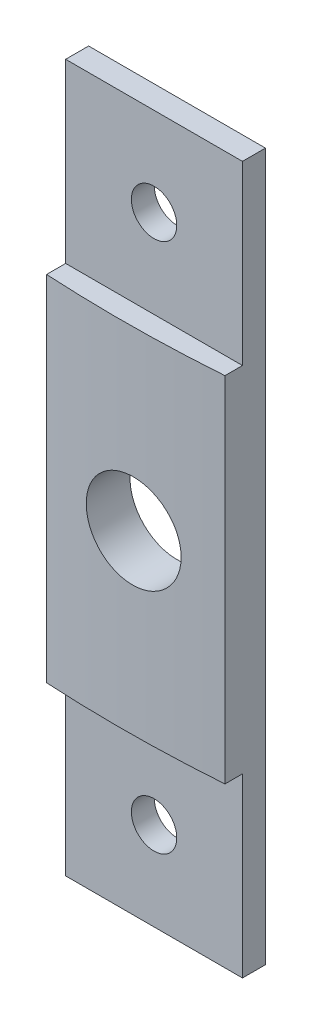
ISO-10303-21;
HEADER;
FILE_DESCRIPTION(('STEP AP214'),'2;1');
FILE_NAME('part.step','',(''),(''),'','','');
FILE_SCHEMA(('AUTOMOTIVE_DESIGN { 1 0 10303 214 1 1 1 1 }'));
ENDSEC;
DATA;
#1=APPLICATION_CONTEXT('core data for automotive mechanical design processes');
#2=APPLICATION_PROTOCOL_DEFINITION('international standard','automotive_design',2000,#1);
#3=PRODUCT_CONTEXT('',#1,'mechanical');
#4=PRODUCT('Part','Part','',(#3));
#5=PRODUCT_RELATED_PRODUCT_CATEGORY('part','',(#4));
#6=PRODUCT_DEFINITION_FORMATION('','',#4);
#7=PRODUCT_DEFINITION_CONTEXT('part definition',#1,'design');
#8=PRODUCT_DEFINITION('design','',#6,#7);
#9=PRODUCT_DEFINITION_SHAPE('','',#8);
#10=(LENGTH_UNIT() NAMED_UNIT(*) SI_UNIT(.MILLI.,.METRE.));
#11=(NAMED_UNIT(*) PLANE_ANGLE_UNIT() SI_UNIT($,.RADIAN.));
#12=(NAMED_UNIT(*) SI_UNIT($,.STERADIAN.) SOLID_ANGLE_UNIT());
#13=UNCERTAINTY_MEASURE_WITH_UNIT(LENGTH_MEASURE(1.E-05),#10,'distance_accuracy_value','');
#14=(GEOMETRIC_REPRESENTATION_CONTEXT(3) GLOBAL_UNCERTAINTY_ASSIGNED_CONTEXT((#13)) GLOBAL_UNIT_ASSIGNED_CONTEXT((#10,
#11,#12)) REPRESENTATION_CONTEXT('',''));
#15=CARTESIAN_POINT('',(0.,0.,0.));
#16=DIRECTION('',(0.,0.,1.));
#17=DIRECTION('',(1.,0.,0.));
#18=AXIS2_PLACEMENT_3D('',#15,#16,#17);
#19=CARTESIAN_POINT('',(0.,-278.797022402708,-95.25));
#20=DIRECTION('',(0.,1.,0.));
#21=DIRECTION('',(0.,0.,1.));
#22=AXIS2_PLACEMENT_3D('',#19,#20,#21);
#23=CYLINDRICAL_SURFACE('',#22,98.425);
#24=CARTESIAN_POINT('',(0.,2.37479674796748,-95.25));
#25=DIRECTION('',(0.,1.,0.));
#26=DIRECTION('',(0.,0.,1.));
#27=AXIS2_PLACEMENT_3D('',#24,#25,#26);
#28=CIRCLE('',#27,98.425);
#29=CARTESIAN_POINT('',(7.22764227642276,2.37479674796748,2.90926758143659));
#30=VERTEX_POINT('',#29);
#31=CARTESIAN_POINT('',(-5.47235772357724,2.37479674796748,3.02275271378738));
#32=VERTEX_POINT('',#31);
#33=EDGE_CURVE('E113',#30,#32,#28,.F.);
#34=ORIENTED_EDGE('',*,*,#33,.F.);
#35=DIRECTION('',(0.,1.,0.));
#36=VECTOR('',#35,1.);
#37=CARTESIAN_POINT('',(7.22764227642279,-278.797022402708,2.90926758143659));
#38=LINE('',#37,#36);
#39=CARTESIAN_POINT('',(7.22764227642276,27.7747967479675,2.9092675814366));
#40=VERTEX_POINT('',#39);
#41=EDGE_CURVE('E118',#40,#30,#38,.F.);
#42=ORIENTED_EDGE('',*,*,#41,.F.);
#43=CARTESIAN_POINT('',(0.,27.7747967479675,-95.25));
#44=DIRECTION('',(0.,-1.,0.));
#45=DIRECTION('',(0.,0.,-1.));
#46=AXIS2_PLACEMENT_3D('',#43,#44,#45);
#47=CIRCLE('',#46,98.425);
#48=CARTESIAN_POINT('',(-5.47235772357724,27.7747967479675,3.02275271378739));
#49=VERTEX_POINT('',#48);
#50=EDGE_CURVE('E48',#40,#49,#47,.T.);
#51=ORIENTED_EDGE('',*,*,#50,.T.);
#52=DIRECTION('',(0.,1.,0.));
#53=VECTOR('',#52,1.);
#54=CARTESIAN_POINT('',(-5.4723577235772,-278.797022402708,3.02275271378739));
#55=LINE('',#54,#53);
#56=EDGE_CURVE('E109',#49,#32,#55,.F.);
#57=ORIENTED_EDGE('',*,*,#56,.T.);
#58=EDGE_LOOP('',(#34,#42,#51,#57));
#59=FACE_BOUND('',#58,.T.);
#60=CARTESIAN_POINT('',(0.,18.337001412705,3.17500000000001));
#61=CARTESIAN_POINT('',(0.183163774329728,18.3862699131995,3.17499923295771));
#62=CARTESIAN_POINT('',(0.370618506350538,18.420112357294,3.1744833048946));
#63=CARTESIAN_POINT('',(0.748696883253728,18.4558831728512,3.17233438141036));
#64=CARTESIAN_POINT('',(0.939324030989922,18.4577735503428,3.17070005851524));
#65=CARTESIAN_POINT('',(1.31810349634827,18.4295342032097,3.16635570330243));
#66=CARTESIAN_POINT('',(1.50625697091006,18.3994200286868,3.16364619378798));
#67=CARTESIAN_POINT('',(1.87477767555351,18.3080601384446,3.15731586236169));
#68=CARTESIAN_POINT('',(2.05514678005276,18.246821963039,3.15369526128434));
#69=CARTESIAN_POINT('',(2.40311827028649,18.0949308812085,3.14581279900255));
#70=CARTESIAN_POINT('',(2.57071528735451,18.0042656886182,3.14155067035122));
#71=CARTESIAN_POINT('',(2.8883186641795,17.7960960163174,3.13273994796942));
#72=CARTESIAN_POINT('',(3.03832427364177,17.6785903924598,3.12819134203307));
#73=CARTESIAN_POINT('',(3.31657209541615,17.4199941230677,3.11920455482662));
#74=CARTESIAN_POINT('',(3.4448015474168,17.2788897446755,3.11476643959231));
#75=CARTESIAN_POINT('',(3.6757511501773,16.9771424388507,3.10640738089549));
#76=CARTESIAN_POINT('',(3.77847135945796,16.8164995562426,3.10248643624655));
#77=CARTESIAN_POINT('',(3.95547236390289,16.4802474922343,3.09552731700965));
#78=CARTESIAN_POINT('',(4.02975622278909,16.3046399256174,3.09248904733113));
#79=CARTESIAN_POINT('',(4.14778175991391,15.9434296465907,3.08758206459831));
#80=CARTESIAN_POINT('',(4.19152365595121,15.7578270054671,3.08571334320381));
#81=CARTESIAN_POINT('',(4.24719352568425,15.3820539635518,3.0833247698372));
#82=CARTESIAN_POINT('',(4.2591469367588,15.1918873379351,3.08280383936196));
#83=CARTESIAN_POINT('',(4.25097162182068,14.8122464901152,3.08315758298348));
#84=CARTESIAN_POINT('',(4.23084296557456,14.6227722664072,3.08403225404533));
#85=CARTESIAN_POINT('',(4.15909521199345,14.2499844164746,3.08709281873213));
#86=CARTESIAN_POINT('',(4.10749047589063,14.066668020909,3.08927811436575));
#87=CARTESIAN_POINT('',(3.97427343139461,13.711301571906,3.09475172078679));
#88=CARTESIAN_POINT('',(3.89266104142145,13.5392515490991,3.09804003457291));
#89=CARTESIAN_POINT('',(3.7016994688612,13.2112048603761,3.10541237133611));
#90=CARTESIAN_POINT('',(3.59233628440084,13.0552163544397,3.10949679575489));
#91=CARTESIAN_POINT('',(3.34899567947401,12.7638052149987,3.11808238570689));
#92=CARTESIAN_POINT('',(3.21501813116291,12.6283826883185,3.12258355340458));
#93=CARTESIAN_POINT('',(2.92612863370945,12.3818379238092,3.13160017938744));
#94=CARTESIAN_POINT('',(2.77120036625512,12.2707348065599,3.1361156461056));
#95=CARTESIAN_POINT('',(2.44488040810793,12.0761153318647,3.14476503433411));
#96=CARTESIAN_POINT('',(2.27348871175923,11.9925989838959,3.1488989557134));
#97=CARTESIAN_POINT('',(1.9190910085905,11.8555237927114,3.15644846982117));
#98=CARTESIAN_POINT('',(1.7360843655135,11.8019665922123,3.15986402315378));
#99=CARTESIAN_POINT('',(1.3636610963515,11.7263456210613,3.16572902326381));
#100=CARTESIAN_POINT('',(1.17424449522206,11.7042817278127,3.16817847380204));
#101=CARTESIAN_POINT('',(0.794502737236001,11.6922846944263,3.17197630756217));
#102=CARTESIAN_POINT('',(0.604178213629432,11.7023317222101,3.17332536975065));
#103=CARTESIAN_POINT('',(0.227911860858423,11.7542315993472,3.174915989193));
#104=CARTESIAN_POINT('',(0.041970021364355,11.7960843737292,3.17515754905743));
#105=CARTESIAN_POINT('',(-0.320181206052002,11.9103859625722,3.17464585069786));
#106=CARTESIAN_POINT('',(-0.496394170491173,11.9828234476875,3.17389296062354));
#107=CARTESIAN_POINT('',(-0.834163478701133,12.1562360566521,3.17161020455872));
#108=CARTESIAN_POINT('',(-0.995719788227125,12.2572112471767,3.17008033675289));
#109=CARTESIAN_POINT('',(-1.29963908752983,12.4848662961968,3.16653675381038));
#110=CARTESIAN_POINT('',(-1.44199664706101,12.6115534018714,3.16452290222816));
#111=CARTESIAN_POINT('',(-1.70342950580691,12.8870213305123,3.1603454308796));
#112=CARTESIAN_POINT('',(-1.82250477877466,13.0358021783854,3.15818181094442));
#113=CARTESIAN_POINT('',(-2.03403509884422,13.3512964635848,3.15403732242825));
#114=CARTESIAN_POINT('',(-2.12648063827912,13.5180162765876,3.15205651928981));
#115=CARTESIAN_POINT('',(-2.28206969548512,13.8646149047119,3.14857148784348));
#116=CARTESIAN_POINT('',(-2.34521318969307,14.044493730415,3.14706725991883));
#117=CARTESIAN_POINT('',(-2.4403977283043,14.4122833549272,3.14475276351811));
#118=CARTESIAN_POINT('',(-2.47244225527235,14.6001932519293,3.14394241734007));
#119=CARTESIAN_POINT('',(-2.50452941165419,14.9787277010001,3.14313097183225));
#120=CARTESIAN_POINT('',(-2.50457203705453,15.1693522534092,3.14312987260395));
#121=CARTESIAN_POINT('',(-2.47265841019071,15.5478526727738,3.14393697143129));
#122=CARTESIAN_POINT('',(-2.44071031229707,15.7357292278062,3.14474496325126));
#123=CARTESIAN_POINT('',(-2.34573740015336,16.1034440766247,3.14705470933214));
#124=CARTESIAN_POINT('',(-2.28271376063673,16.2832826739854,3.14855643736795));
#125=CARTESIAN_POINT('',(-2.12738281212904,16.6298260717582,3.15203692611609));
#126=CARTESIAN_POINT('',(-2.03507574237078,16.7965309794529,3.15401568293126));
#127=CARTESIAN_POINT('',(-1.82376422734408,17.1121244745433,3.15815836651779));
#128=CARTESIAN_POINT('',(-1.70475316928609,17.2610086349057,3.16032233907243));
#129=CARTESIAN_POINT('',(-1.44334539317461,17.5367861292119,3.16450326839776));
#130=CARTESIAN_POINT('',(-1.30093105885671,17.6636627484751,3.16652011275713));
#131=CARTESIAN_POINT('',(-0.9969207175112,17.8915784422674,3.17006789259945));
#132=CARTESIAN_POINT('',(-0.835347778578186,17.9926481364311,3.17159940444944));
#133=CARTESIAN_POINT('',(-0.560410582586963,18.1339668027216,3.17346205936598));
#134=CARTESIAN_POINT('',(-0.451402499054938,18.1828684278914,3.17402774268829));
#135=CARTESIAN_POINT('',(-0.22882937043118,18.2688834853283,3.17479695436329));
#136=CARTESIAN_POINT('',(-0.115264325101369,18.3059969169796,3.17500048269706));
#137=CARTESIAN_POINT('',(0.,18.337001412705,3.17500000000001));
#138=B_SPLINE_CURVE_WITH_KNOTS('',3,(#60,#61,#62,#63,#64,#65,#66,#67,#68,#69,#70,#71,#72,#73,
#74,#75,#76,#77,#78,#79,#80,#81,#82,#83,#84,#85,#86,#87,#88,#89,#90,#91,#92,#93,#94,#95,#96,#97,
#98,#99,#100,#101,#102,#103,#104,#105,#106,#107,#108,#109,#110,#111,#112,#113,#114,#115,#116,
#117,#118,#119,#120,#121,#122,#123,#124,#125,#126,#127,#128,#129,#130,#131,#132,#133,#134,#135,
#136,#137),.UNSPECIFIED.,.T.,.F.,(4,2,2,2,2,2,2,2,2,2,2,2,2,2,2,2,2,2,2,2,2,2,2,2,2,2,2,2,2,2,2,
2,2,2,2,2,2,2,4),(0.,0.56858743862936,1.13785093296673,1.70683796475568,2.27568721550947,
2.84477427445617,3.41388559683012,3.98332926276382,4.55277162232337,5.12215261309395,
5.69152954349385,6.26045071700899,6.82937065333402,7.39803120901285,7.96669331068534,
8.53564290763281,9.10459545973286,9.67399374371524,10.2433922233086,10.8128219210355,
11.3822494020859,11.9513252660743,12.5203997886633,13.0892636964301,13.6581289332947,
14.2271547341611,14.7961811765071,15.365410528405,15.9346403380459,16.5038063961,
17.072972525535,17.6419936125993,18.210993190888,18.7799881208193,19.3491241084971,
19.9186904788546,20.4875778913981,20.845387967056,21.2031980614077),.UNSPECIFIED.);
#139=CARTESIAN_POINT('',(0.,18.337001412705,3.17500000000001));
#140=VERTEX_POINT('',#139);
#141=EDGE_CURVE('E12',#140,#140,#138,.T.);
#142=ORIENTED_EDGE('',*,*,#141,.T.);
#143=EDGE_LOOP('',(#142));
#144=FACE_BOUND('',#143,.T.);
#145=ADVANCED_FACE('F39',(#59,#144),#23,.T.);
#146=CARTESIAN_POINT('',(-5.47235772357724,40.4747967479675,3.175));
#147=DIRECTION('',(1.,0.,0.));
#148=DIRECTION('',(0.,1.,0.));
#149=AXIS2_PLACEMENT_3D('',#146,#147,#148);
#150=PLANE('',#149);
#151=ORIENTED_EDGE('',*,*,#56,.F.);
#152=DIRECTION('',(0.,0.,-1.));
#153=VECTOR('',#152,1.);
#154=CARTESIAN_POINT('',(-5.47235772357724,27.7747967479675,3.175));
#155=LINE('',#154,#153);
#156=CARTESIAN_POINT('',(-5.47235772357724,27.7747967479675,1.651));
#157=VERTEX_POINT('',#156);
#158=EDGE_CURVE('E227',#49,#157,#155,.T.);
#159=ORIENTED_EDGE('',*,*,#158,.T.);
#160=DIRECTION('',(0.,1.,0.));
#161=VECTOR('',#160,1.);
#162=CARTESIAN_POINT('',(-5.47235772357724,40.4747967479675,1.651));
#163=LINE('',#162,#161);
#164=CARTESIAN_POINT('',(-5.47235772357724,40.4747967479675,1.651));
#165=VERTEX_POINT('',#164);
#166=EDGE_CURVE('E224',#157,#165,#163,.T.);
#167=ORIENTED_EDGE('',*,*,#166,.T.);
#168=DIRECTION('',(0.,0.,-1.));
#169=VECTOR('',#168,1.);
#170=CARTESIAN_POINT('',(-5.47235772357724,40.4747967479675,3.175));
#171=LINE('',#170,#169);
#172=CARTESIAN_POINT('',(-5.47235772357724,40.4747967479675,0.));
#173=VERTEX_POINT('',#172);
#174=EDGE_CURVE('E56',#165,#173,#171,.T.);
#175=ORIENTED_EDGE('',*,*,#174,.T.);
#176=DIRECTION('',(0.,-1.,0.));
#177=VECTOR('',#176,1.);
#178=CARTESIAN_POINT('',(-5.47235772357724,40.4747967479675,0.));
#179=LINE('',#178,#177);
#180=CARTESIAN_POINT('',(-5.47235772357724,-10.3252032520325,0.));
#181=VERTEX_POINT('',#180);
#182=EDGE_CURVE('E141',#173,#181,#179,.T.);
#183=ORIENTED_EDGE('',*,*,#182,.T.);
#184=DIRECTION('',(0.,0.,-1.));
#185=VECTOR('',#184,1.);
#186=CARTESIAN_POINT('',(-5.47235772357724,-10.3252032520325,3.175));
#187=LINE('',#186,#185);
#188=CARTESIAN_POINT('',(-5.47235772357724,-10.3252032520325,1.651));
#189=VERTEX_POINT('',#188);
#190=EDGE_CURVE('E157',#189,#181,#187,.T.);
#191=ORIENTED_EDGE('',*,*,#190,.F.);
#192=DIRECTION('',(0.,1.,0.));
#193=VECTOR('',#192,1.);
#194=CARTESIAN_POINT('',(-5.47235772357724,-10.3252032520325,1.651));
#195=LINE('',#194,#193);
#196=CARTESIAN_POINT('',(-5.47235772357724,2.37479674796748,1.651));
#197=VERTEX_POINT('',#196);
#198=EDGE_CURVE('E131',#189,#197,#195,.T.);
#199=ORIENTED_EDGE('',*,*,#198,.T.);
#200=DIRECTION('',(0.,0.,1.));
#201=VECTOR('',#200,1.);
#202=CARTESIAN_POINT('',(-5.47235772357724,2.37479674796748,3.175));
#203=LINE('',#202,#201);
#204=EDGE_CURVE('E124',#197,#32,#203,.T.);
#205=ORIENTED_EDGE('',*,*,#204,.T.);
#206=EDGE_LOOP('',(#151,#159,#167,#175,#183,#191,#199,#205));
#207=FACE_BOUND('',#206,.T.);
#208=ADVANCED_FACE('F41',(#207),#150,.F.);
#209=CARTESIAN_POINT('',(7.22764227642276,40.4747967479675,3.175));
#210=DIRECTION('',(1.,0.,0.));
#211=DIRECTION('',(0.,1.,0.));
#212=AXIS2_PLACEMENT_3D('',#209,#210,#211);
#213=PLANE('',#212);
#214=DIRECTION('',(0.,0.,-1.));
#215=VECTOR('',#214,1.);
#216=CARTESIAN_POINT('',(7.22764227642276,27.7747967479675,3.175));
#217=LINE('',#216,#215);
#218=CARTESIAN_POINT('',(7.22764227642276,27.7747967479675,1.651));
#219=VERTEX_POINT('',#218);
#220=EDGE_CURVE('E139',#40,#219,#217,.T.);
#221=ORIENTED_EDGE('',*,*,#220,.F.);
#222=ORIENTED_EDGE('',*,*,#41,.T.);
#223=DIRECTION('',(0.,0.,1.));
#224=VECTOR('',#223,1.);
#225=CARTESIAN_POINT('',(7.22764227642276,2.37479674796748,3.175));
#226=LINE('',#225,#224);
#227=CARTESIAN_POINT('',(7.22764227642276,2.37479674796748,1.651));
#228=VERTEX_POINT('',#227);
#229=EDGE_CURVE('E127',#228,#30,#226,.T.);
#230=ORIENTED_EDGE('',*,*,#229,.F.);
#231=DIRECTION('',(0.,1.,0.));
#232=VECTOR('',#231,1.);
#233=CARTESIAN_POINT('',(7.22764227642276,-10.3252032520325,1.651));
#234=LINE('',#233,#232);
#235=CARTESIAN_POINT('',(7.22764227642276,-10.3252032520325,1.651));
#236=VERTEX_POINT('',#235);
#237=EDGE_CURVE('E117',#236,#228,#234,.T.);
#238=ORIENTED_EDGE('',*,*,#237,.F.);
#239=DIRECTION('',(0.,0.,-1.));
#240=VECTOR('',#239,1.);
#241=CARTESIAN_POINT('',(7.22764227642276,-10.3252032520325,3.175));
#242=LINE('',#241,#240);
#243=CARTESIAN_POINT('',(7.22764227642276,-10.3252032520325,0.));
#244=VERTEX_POINT('',#243);
#245=EDGE_CURVE('E155',#236,#244,#242,.T.);
#246=ORIENTED_EDGE('',*,*,#245,.T.);
#247=DIRECTION('',(0.,-1.,0.));
#248=VECTOR('',#247,1.);
#249=CARTESIAN_POINT('',(7.22764227642276,40.4747967479675,0.));
#250=LINE('',#249,#248);
#251=CARTESIAN_POINT('',(7.22764227642276,40.4747967479675,0.));
#252=VERTEX_POINT('',#251);
#253=EDGE_CURVE('E147',#252,#244,#250,.T.);
#254=ORIENTED_EDGE('',*,*,#253,.F.);
#255=DIRECTION('',(0.,0.,-1.));
#256=VECTOR('',#255,1.);
#257=CARTESIAN_POINT('',(7.22764227642276,40.4747967479675,3.175));
#258=LINE('',#257,#256);
#259=CARTESIAN_POINT('',(7.22764227642276,40.4747967479675,1.651));
#260=VERTEX_POINT('',#259);
#261=EDGE_CURVE('E64',#260,#252,#258,.T.);
#262=ORIENTED_EDGE('',*,*,#261,.F.);
#263=DIRECTION('',(0.,1.,0.));
#264=VECTOR('',#263,1.);
#265=CARTESIAN_POINT('',(7.22764227642276,40.4747967479675,1.651));
#266=LINE('',#265,#264);
#267=EDGE_CURVE('E229',#219,#260,#266,.T.);
#268=ORIENTED_EDGE('',*,*,#267,.F.);
#269=EDGE_LOOP('',(#221,#222,#230,#238,#246,#254,#262,#268));
#270=FACE_BOUND('',#269,.T.);
#271=ADVANCED_FACE('F188',(#270),#213,.T.);
#272=CARTESIAN_POINT('',(-5.47235772357724,2.37479674796748,3.175));
#273=DIRECTION('',(0.,1.,0.));
#274=DIRECTION('',(0.,0.,1.));
#275=AXIS2_PLACEMENT_3D('',#272,#273,#274);
#276=PLANE('',#275);
#277=ORIENTED_EDGE('',*,*,#229,.T.);
#278=ORIENTED_EDGE('',*,*,#33,.T.);
#279=ORIENTED_EDGE('',*,*,#204,.F.);
#280=DIRECTION('',(1.,0.,0.));
#281=VECTOR('',#280,1.);
#282=CARTESIAN_POINT('',(-5.47235772357724,2.37479674796748,1.651));
#283=LINE('',#282,#281);
#284=EDGE_CURVE('E134',#197,#228,#283,.T.);
#285=ORIENTED_EDGE('',*,*,#284,.T.);
#286=EDGE_LOOP('',(#277,#278,#279,#285));
#287=FACE_BOUND('',#286,.T.);
#288=ADVANCED_FACE('F123',(#287),#276,.F.);
#289=CARTESIAN_POINT('',(-5.47235772357724,27.7747967479675,3.175));
#290=DIRECTION('',(0.,-1.,0.));
#291=DIRECTION('',(0.,0.,-1.));
#292=AXIS2_PLACEMENT_3D('',#289,#290,#291);
#293=PLANE('',#292);
#294=ORIENTED_EDGE('',*,*,#50,.F.);
#295=ORIENTED_EDGE('',*,*,#220,.T.);
#296=DIRECTION('',(1.,0.,0.));
#297=VECTOR('',#296,1.);
#298=CARTESIAN_POINT('',(-5.47235772357724,27.7747967479675,1.651));
#299=LINE('',#298,#297);
#300=EDGE_CURVE('E221',#157,#219,#299,.T.);
#301=ORIENTED_EDGE('',*,*,#300,.F.);
#302=ORIENTED_EDGE('',*,*,#158,.F.);
#303=EDGE_LOOP('',(#294,#295,#301,#302));
#304=FACE_BOUND('',#303,.T.);
#305=ADVANCED_FACE('F197',(#304),#293,.F.);
#306=CARTESIAN_POINT('',(-5.47235772357724,-10.3252032520325,3.175));
#307=DIRECTION('',(0.,1.,0.));
#308=DIRECTION('',(0.,0.,1.));
#309=AXIS2_PLACEMENT_3D('',#306,#307,#308);
#310=PLANE('',#309);
#311=ORIENTED_EDGE('',*,*,#245,.F.);
#312=DIRECTION('',(1.,0.,0.));
#313=VECTOR('',#312,1.);
#314=CARTESIAN_POINT('',(-5.47235772357724,-10.3252032520325,1.651));
#315=LINE('',#314,#313);
#316=EDGE_CURVE('E132',#189,#236,#315,.T.);
#317=ORIENTED_EDGE('',*,*,#316,.F.);
#318=ORIENTED_EDGE('',*,*,#190,.T.);
#319=DIRECTION('',(1.,0.,0.));
#320=VECTOR('',#319,1.);
#321=CARTESIAN_POINT('',(-5.47235772357724,-10.3252032520325,0.));
#322=LINE('',#321,#320);
#323=EDGE_CURVE('E143',#181,#244,#322,.T.);
#324=ORIENTED_EDGE('',*,*,#323,.T.);
#325=EDGE_LOOP('',(#311,#317,#318,#324));
#326=FACE_BOUND('',#325,.T.);
#327=ADVANCED_FACE('F203',(#326),#310,.F.);
#328=CARTESIAN_POINT('',(-5.47235772357724,40.4747967479675,3.175));
#329=DIRECTION('',(0.,1.,0.));
#330=DIRECTION('',(0.,0.,1.));
#331=AXIS2_PLACEMENT_3D('',#328,#329,#330);
#332=PLANE('',#331);
#333=DIRECTION('',(1.,0.,0.));
#334=VECTOR('',#333,1.);
#335=CARTESIAN_POINT('',(-5.47235772357724,40.4747967479675,1.651));
#336=LINE('',#335,#334);
#337=EDGE_CURVE('E144',#165,#260,#336,.T.);
#338=ORIENTED_EDGE('',*,*,#337,.T.);
#339=ORIENTED_EDGE('',*,*,#261,.T.);
#340=DIRECTION('',(1.,0.,0.));
#341=VECTOR('',#340,1.);
#342=CARTESIAN_POINT('',(-5.47235772357724,40.4747967479675,0.));
#343=LINE('',#342,#341);
#344=EDGE_CURVE('E150',#173,#252,#343,.T.);
#345=ORIENTED_EDGE('',*,*,#344,.F.);
#346=ORIENTED_EDGE('',*,*,#174,.F.);
#347=EDGE_LOOP('',(#338,#339,#345,#346));
#348=FACE_BOUND('',#347,.T.);
#349=ADVANCED_FACE('F201',(#348),#332,.T.);
#350=CARTESIAN_POINT('',(0.,0.,0.));
#351=DIRECTION('',(0.,0.,1.));
#352=DIRECTION('',(1.,0.,0.));
#353=AXIS2_PLACEMENT_3D('',#350,#351,#352);
#354=PLANE('',#353);
#355=CARTESIAN_POINT('',(0.877642276422763,-3.97520325203252,0.));
#356=DIRECTION('',(0.,0.,1.));
#357=DIRECTION('',(1.,0.,0.));
#358=AXIS2_PLACEMENT_3D('',#355,#356,#357);
#359=CIRCLE('',#358,1.63195);
#360=CARTESIAN_POINT('',(-0.754307723577237,-3.97520325203252,0.));
#361=VERTEX_POINT('',#360);
#362=EDGE_CURVE('E128',#361,#361,#359,.F.);
#363=ORIENTED_EDGE('',*,*,#362,.F.);
#364=EDGE_LOOP('',(#363));
#365=FACE_BOUND('',#364,.T.);
#366=CARTESIAN_POINT('',(0.877642276422763,34.1247967479675,0.));
#367=DIRECTION('',(0.,0.,1.));
#368=DIRECTION('',(1.,0.,0.));
#369=AXIS2_PLACEMENT_3D('',#366,#367,#368);
#370=CIRCLE('',#369,1.63195);
#371=CARTESIAN_POINT('',(-0.754307723577237,34.1247967479675,0.));
#372=VERTEX_POINT('',#371);
#373=EDGE_CURVE('E235',#372,#372,#370,.F.);
#374=ORIENTED_EDGE('',*,*,#373,.F.);
#375=EDGE_LOOP('',(#374));
#376=FACE_BOUND('',#375,.T.);
#377=CARTESIAN_POINT('',(0.877642276422763,15.0747967479675,0.));
#378=DIRECTION('',(0.,0.,1.));
#379=DIRECTION('',(1.,0.,0.));
#380=AXIS2_PLACEMENT_3D('',#377,#378,#379);
#381=CIRCLE('',#380,3.3782);
#382=CARTESIAN_POINT('',(4.25584227642276,15.0747967479675,0.));
#383=VERTEX_POINT('',#382);
#384=EDGE_CURVE('E238',#383,#383,#381,.F.);
#385=ORIENTED_EDGE('',*,*,#384,.F.);
#386=EDGE_LOOP('',(#385));
#387=FACE_BOUND('',#386,.T.);
#388=ORIENTED_EDGE('',*,*,#182,.F.);
#389=ORIENTED_EDGE('',*,*,#344,.T.);
#390=ORIENTED_EDGE('',*,*,#253,.T.);
#391=ORIENTED_EDGE('',*,*,#323,.F.);
#392=EDGE_LOOP('',(#388,#389,#390,#391));
#393=FACE_BOUND('',#392,.T.);
#394=ADVANCED_FACE('F210',(#365,#376,#387,#393),#354,.F.);
#395=CARTESIAN_POINT('',(-5.47235772357724,-10.3252032520325,1.651));
#396=DIRECTION('',(0.,0.,-1.));
#397=DIRECTION('',(-1.,0.,0.));
#398=AXIS2_PLACEMENT_3D('',#395,#396,#397);
#399=PLANE('',#398);
#400=CARTESIAN_POINT('',(0.877642276422763,-3.97520325203252,1.651));
#401=DIRECTION('',(0.,0.,-1.));
#402=DIRECTION('',(-1.,0.,0.));
#403=AXIS2_PLACEMENT_3D('',#400,#401,#402);
#404=CIRCLE('',#403,1.63195);
#405=CARTESIAN_POINT('',(-0.754307723577237,-3.97520325203252,1.651));
#406=VERTEX_POINT('',#405);
#407=EDGE_CURVE('E43',#406,#406,#404,.F.);
#408=ORIENTED_EDGE('',*,*,#407,.F.);
#409=EDGE_LOOP('',(#408));
#410=FACE_BOUND('',#409,.T.);
#411=ORIENTED_EDGE('',*,*,#284,.F.);
#412=ORIENTED_EDGE('',*,*,#198,.F.);
#413=ORIENTED_EDGE('',*,*,#316,.T.);
#414=ORIENTED_EDGE('',*,*,#237,.T.);
#415=EDGE_LOOP('',(#411,#412,#413,#414));
#416=FACE_BOUND('',#415,.T.);
#417=ADVANCED_FACE('F248',(#410,#416),#399,.F.);
#418=CARTESIAN_POINT('',(-5.47235772357724,40.4747967479675,1.651));
#419=DIRECTION('',(0.,0.,-1.));
#420=DIRECTION('',(0.,1.,0.));
#421=AXIS2_PLACEMENT_3D('',#418,#419,#420);
#422=PLANE('',#421);
#423=CARTESIAN_POINT('',(0.877642276422763,34.1247967479675,1.651));
#424=DIRECTION('',(0.,0.,-1.));
#425=DIRECTION('',(0.,1.,0.));
#426=AXIS2_PLACEMENT_3D('',#423,#424,#425);
#427=CIRCLE('',#426,1.63195);
#428=CARTESIAN_POINT('',(-0.754307723577237,34.1247967479675,1.651));
#429=VERTEX_POINT('',#428);
#430=EDGE_CURVE('E164',#429,#429,#427,.F.);
#431=ORIENTED_EDGE('',*,*,#430,.F.);
#432=EDGE_LOOP('',(#431));
#433=FACE_BOUND('',#432,.T.);
#434=ORIENTED_EDGE('',*,*,#337,.F.);
#435=ORIENTED_EDGE('',*,*,#166,.F.);
#436=ORIENTED_EDGE('',*,*,#300,.T.);
#437=ORIENTED_EDGE('',*,*,#267,.T.);
#438=EDGE_LOOP('',(#434,#435,#436,#437));
#439=FACE_BOUND('',#438,.T.);
#440=ADVANCED_FACE('F172',(#433,#439),#422,.F.);
#441=CARTESIAN_POINT('',(0.877642276422763,15.0747967479675,3.17500000000001));
#442=DIRECTION('',(0.,0.,-1.));
#443=DIRECTION('',(-1.,0.,0.));
#444=AXIS2_PLACEMENT_3D('',#441,#442,#443);
#445=CYLINDRICAL_SURFACE('',#444,3.3782);
#446=ORIENTED_EDGE('',*,*,#141,.F.);
#447=EDGE_LOOP('',(#446));
#448=FACE_BOUND('',#447,.T.);
#449=ORIENTED_EDGE('',*,*,#384,.T.);
#450=EDGE_LOOP('',(#449));
#451=FACE_BOUND('',#450,.T.);
#452=ADVANCED_FACE('F167',(#448,#451),#445,.F.);
#453=CARTESIAN_POINT('',(0.877642276422763,34.1247967479675,3.17500000000001));
#454=DIRECTION('',(0.,0.,-1.));
#455=DIRECTION('',(-1.,0.,0.));
#456=AXIS2_PLACEMENT_3D('',#453,#454,#455);
#457=CYLINDRICAL_SURFACE('',#456,1.63195);
#458=CARTESIAN_POINT('',(-0.754307723577237,34.1247967479675,1.651));
#459=CARTESIAN_POINT('',(-0.754307723577237,34.1247967479675,1.63380208333333));
#460=CARTESIAN_POINT('',(-0.754307723577237,34.1247967479675,1.61660416666667));
#461=CARTESIAN_POINT('',(-0.754307723577237,34.1247967479675,1.58220833333333));
#462=CARTESIAN_POINT('',(-0.754307723577237,34.1247967479675,1.56501041666667));
#463=CARTESIAN_POINT('',(-0.754307723577237,34.1247967479675,1.53061458333333));
#464=CARTESIAN_POINT('',(-0.754307723577237,34.1247967479675,1.51341666666667));
#465=CARTESIAN_POINT('',(-0.754307723577237,34.1247967479675,1.47902083333333));
#466=CARTESIAN_POINT('',(-0.754307723577237,34.1247967479675,1.46182291666667));
#467=CARTESIAN_POINT('',(-0.754307723577237,34.1247967479675,1.42742708333333));
#468=CARTESIAN_POINT('',(-0.754307723577237,34.1247967479675,1.41022916666667));
#469=CARTESIAN_POINT('',(-0.754307723577237,34.1247967479675,1.37583333333333));
#470=CARTESIAN_POINT('',(-0.754307723577237,34.1247967479675,1.35863541666667));
#471=CARTESIAN_POINT('',(-0.754307723577237,34.1247967479675,1.32423958333333));
#472=CARTESIAN_POINT('',(-0.754307723577237,34.1247967479675,1.30704166666667));
#473=CARTESIAN_POINT('',(-0.754307723577237,34.1247967479675,1.27264583333333));
#474=CARTESIAN_POINT('',(-0.754307723577237,34.1247967479675,1.25544791666667));
#475=CARTESIAN_POINT('',(-0.754307723577237,34.1247967479675,1.22105208333333));
#476=CARTESIAN_POINT('',(-0.754307723577237,34.1247967479675,1.20385416666667));
#477=CARTESIAN_POINT('',(-0.754307723577237,34.1247967479675,1.16945833333333));
#478=CARTESIAN_POINT('',(-0.754307723577237,34.1247967479675,1.15226041666667));
#479=CARTESIAN_POINT('',(-0.754307723577237,34.1247967479675,1.11786458333333));
#480=CARTESIAN_POINT('',(-0.754307723577237,34.1247967479675,1.10066666666667));
#481=CARTESIAN_POINT('',(-0.754307723577237,34.1247967479675,1.06627083333333));
#482=CARTESIAN_POINT('',(-0.754307723577237,34.1247967479675,1.04907291666667));
#483=CARTESIAN_POINT('',(-0.754307723577237,34.1247967479675,1.01467708333333));
#484=CARTESIAN_POINT('',(-0.754307723577237,34.1247967479675,0.997479166666666));
#485=CARTESIAN_POINT('',(-0.754307723577237,34.1247967479675,0.963083333333333));
#486=CARTESIAN_POINT('',(-0.754307723577237,34.1247967479675,0.945885416666666));
#487=CARTESIAN_POINT('',(-0.754307723577237,34.1247967479675,0.911489583333333));
#488=CARTESIAN_POINT('',(-0.754307723577237,34.1247967479675,0.894291666666666));
#489=CARTESIAN_POINT('',(-0.754307723577237,34.1247967479675,0.859895833333333));
#490=CARTESIAN_POINT('',(-0.754307723577237,34.1247967479675,0.842697916666666));
#491=CARTESIAN_POINT('',(-0.754307723577237,34.1247967479675,0.808302083333333));
#492=CARTESIAN_POINT('',(-0.754307723577237,34.1247967479675,0.791104166666666));
#493=CARTESIAN_POINT('',(-0.754307723577237,34.1247967479675,0.756708333333333));
#494=CARTESIAN_POINT('',(-0.754307723577237,34.1247967479675,0.739510416666666));
#495=CARTESIAN_POINT('',(-0.754307723577237,34.1247967479675,0.705114583333333));
#496=CARTESIAN_POINT('',(-0.754307723577237,34.1247967479675,0.687916666666666));
#497=CARTESIAN_POINT('',(-0.754307723577237,34.1247967479675,0.653520833333333));
#498=CARTESIAN_POINT('',(-0.754307723577237,34.1247967479675,0.636322916666666));
#499=CARTESIAN_POINT('',(-0.754307723577237,34.1247967479675,0.601927083333333));
#500=CARTESIAN_POINT('',(-0.754307723577237,34.1247967479675,0.584729166666666));
#501=CARTESIAN_POINT('',(-0.754307723577237,34.1247967479675,0.550333333333333));
#502=CARTESIAN_POINT('',(-0.754307723577237,34.1247967479675,0.533135416666666));
#503=CARTESIAN_POINT('',(-0.754307723577237,34.1247967479675,0.498739583333333));
#504=CARTESIAN_POINT('',(-0.754307723577237,34.1247967479675,0.481541666666666));
#505=CARTESIAN_POINT('',(-0.754307723577237,34.1247967479675,0.447145833333333));
#506=CARTESIAN_POINT('',(-0.754307723577237,34.1247967479675,0.429947916666666));
#507=CARTESIAN_POINT('',(-0.754307723577237,34.1247967479675,0.395552083333333));
#508=CARTESIAN_POINT('',(-0.754307723577237,34.1247967479675,0.378354166666666));
#509=CARTESIAN_POINT('',(-0.754307723577237,34.1247967479675,0.343958333333333));
#510=CARTESIAN_POINT('',(-0.754307723577237,34.1247967479675,0.326760416666666));
#511=CARTESIAN_POINT('',(-0.754307723577237,34.1247967479675,0.292364583333333));
#512=CARTESIAN_POINT('',(-0.754307723577237,34.1247967479675,0.275166666666666));
#513=CARTESIAN_POINT('',(-0.754307723577237,34.1247967479675,0.240770833333333));
#514=CARTESIAN_POINT('',(-0.754307723577237,34.1247967479675,0.223572916666666));
#515=CARTESIAN_POINT('',(-0.754307723577237,34.1247967479675,0.189177083333333));
#516=CARTESIAN_POINT('',(-0.754307723577237,34.1247967479675,0.171979166666666));
#517=CARTESIAN_POINT('',(-0.754307723577237,34.1247967479675,0.137583333333333));
#518=CARTESIAN_POINT('',(-0.754307723577237,34.1247967479675,0.120385416666666));
#519=CARTESIAN_POINT('',(-0.754307723577237,34.1247967479675,0.0859895833333329));
#520=CARTESIAN_POINT('',(-0.754307723577237,34.1247967479675,0.0687916666666662));
#521=CARTESIAN_POINT('',(-0.754307723577237,34.1247967479675,0.0343958333333329));
#522=CARTESIAN_POINT('',(-0.754307723577237,34.1247967479675,0.0171979166666662));
#523=CARTESIAN_POINT('',(-0.754307723577237,34.1247967479675,0.));
#524=B_SPLINE_CURVE_WITH_KNOTS('',3,(#458,#459,#460,#461,#462,#463,#464,#465,#466,#467,#468,
#469,#470,#471,#472,#473,#474,#475,#476,#477,#478,#479,#480,#481,#482,#483,#484,#485,#486,#487,
#488,#489,#490,#491,#492,#493,#494,#495,#496,#497,#498,#499,#500,#501,#502,#503,#504,#505,#506,
#507,#508,#509,#510,#511,#512,#513,#514,#515,#516,#517,#518,#519,#520,#521,#522,#523),
.UNSPECIFIED.,.F.,.F.,(4,2,2,2,2,2,2,2,2,2,2,2,2,2,2,2,2,2,2,2,2,2,2,2,2,2,2,2,2,2,2,2,4),(0.,
0.05159375,0.1031875,0.15478125,0.206375,0.25796875,0.3095625,0.36115625,0.41275,0.46434375,
0.5159375,0.56753125,0.619125,0.67071875,0.7223125,0.77390625,0.8255,0.87709375,0.9286875,
0.98028125,1.031875,1.08346875,1.1350625,1.18665625,1.23825,1.28984375,1.3414375,1.39303125,
1.444625,1.49621875,1.5478125,1.59940625,1.651),.UNSPECIFIED.);
#525=EDGE_CURVE('BSEAM171',#429,#372,#524,.T.);
#526=ORIENTED_EDGE('',*,*,#430,.T.);
#527=ORIENTED_EDGE('',*,*,#373,.T.);
#528=ORIENTED_EDGE('',*,*,#525,.T.);
#529=ORIENTED_EDGE('',*,*,#525,.F.);
#530=EDGE_LOOP('',(#526,#528,#527,#529));
#531=FACE_BOUND('',#530,.T.);
#532=ADVANCED_FACE('F171',(#531),#457,.F.);
#533=CARTESIAN_POINT('',(0.877642276422763,-3.97520325203252,3.17500000000001));
#534=DIRECTION('',(0.,0.,-1.));
#535=DIRECTION('',(-1.,0.,0.));
#536=AXIS2_PLACEMENT_3D('',#533,#534,#535);
#537=CYLINDRICAL_SURFACE('',#536,1.63195);
#538=CARTESIAN_POINT('',(-0.754307723577237,-3.97520325203252,1.651));
#539=CARTESIAN_POINT('',(-0.754307723577237,-3.97520325203252,1.63380208333333));
#540=CARTESIAN_POINT('',(-0.754307723577237,-3.97520325203252,1.61660416666667));
#541=CARTESIAN_POINT('',(-0.754307723577237,-3.97520325203252,1.58220833333333));
#542=CARTESIAN_POINT('',(-0.754307723577237,-3.97520325203252,1.56501041666667));
#543=CARTESIAN_POINT('',(-0.754307723577237,-3.97520325203252,1.53061458333333));
#544=CARTESIAN_POINT('',(-0.754307723577237,-3.97520325203252,1.51341666666667));
#545=CARTESIAN_POINT('',(-0.754307723577237,-3.97520325203252,1.47902083333333));
#546=CARTESIAN_POINT('',(-0.754307723577237,-3.97520325203252,1.46182291666667));
#547=CARTESIAN_POINT('',(-0.754307723577237,-3.97520325203252,1.42742708333333));
#548=CARTESIAN_POINT('',(-0.754307723577237,-3.97520325203252,1.41022916666667));
#549=CARTESIAN_POINT('',(-0.754307723577237,-3.97520325203252,1.37583333333333));
#550=CARTESIAN_POINT('',(-0.754307723577237,-3.97520325203252,1.35863541666667));
#551=CARTESIAN_POINT('',(-0.754307723577237,-3.97520325203252,1.32423958333333));
#552=CARTESIAN_POINT('',(-0.754307723577237,-3.97520325203252,1.30704166666667));
#553=CARTESIAN_POINT('',(-0.754307723577237,-3.97520325203252,1.27264583333333));
#554=CARTESIAN_POINT('',(-0.754307723577237,-3.97520325203252,1.25544791666667));
#555=CARTESIAN_POINT('',(-0.754307723577237,-3.97520325203252,1.22105208333333));
#556=CARTESIAN_POINT('',(-0.754307723577237,-3.97520325203252,1.20385416666667));
#557=CARTESIAN_POINT('',(-0.754307723577237,-3.97520325203252,1.16945833333333));
#558=CARTESIAN_POINT('',(-0.754307723577237,-3.97520325203252,1.15226041666667));
#559=CARTESIAN_POINT('',(-0.754307723577237,-3.97520325203252,1.11786458333333));
#560=CARTESIAN_POINT('',(-0.754307723577237,-3.97520325203252,1.10066666666667));
#561=CARTESIAN_POINT('',(-0.754307723577237,-3.97520325203252,1.06627083333333));
#562=CARTESIAN_POINT('',(-0.754307723577237,-3.97520325203252,1.04907291666667));
#563=CARTESIAN_POINT('',(-0.754307723577237,-3.97520325203252,1.01467708333333));
#564=CARTESIAN_POINT('',(-0.754307723577237,-3.97520325203252,0.997479166666666));
#565=CARTESIAN_POINT('',(-0.754307723577237,-3.97520325203252,0.963083333333333));
#566=CARTESIAN_POINT('',(-0.754307723577237,-3.97520325203252,0.945885416666666));
#567=CARTESIAN_POINT('',(-0.754307723577237,-3.97520325203252,0.911489583333333));
#568=CARTESIAN_POINT('',(-0.754307723577237,-3.97520325203252,0.894291666666666));
#569=CARTESIAN_POINT('',(-0.754307723577237,-3.97520325203252,0.859895833333333));
#570=CARTESIAN_POINT('',(-0.754307723577237,-3.97520325203252,0.842697916666666));
#571=CARTESIAN_POINT('',(-0.754307723577237,-3.97520325203252,0.808302083333333));
#572=CARTESIAN_POINT('',(-0.754307723577237,-3.97520325203252,0.791104166666666));
#573=CARTESIAN_POINT('',(-0.754307723577237,-3.97520325203252,0.756708333333333));
#574=CARTESIAN_POINT('',(-0.754307723577237,-3.97520325203252,0.739510416666667));
#575=CARTESIAN_POINT('',(-0.754307723577237,-3.97520325203252,0.705114583333333));
#576=CARTESIAN_POINT('',(-0.754307723577237,-3.97520325203252,0.687916666666667));
#577=CARTESIAN_POINT('',(-0.754307723577237,-3.97520325203252,0.653520833333333));
#578=CARTESIAN_POINT('',(-0.754307723577237,-3.97520325203252,0.636322916666667));
#579=CARTESIAN_POINT('',(-0.754307723577237,-3.97520325203252,0.601927083333333));
#580=CARTESIAN_POINT('',(-0.754307723577237,-3.97520325203252,0.584729166666667));
#581=CARTESIAN_POINT('',(-0.754307723577237,-3.97520325203252,0.550333333333333));
#582=CARTESIAN_POINT('',(-0.754307723577237,-3.97520325203252,0.533135416666666));
#583=CARTESIAN_POINT('',(-0.754307723577237,-3.97520325203252,0.498739583333333));
#584=CARTESIAN_POINT('',(-0.754307723577237,-3.97520325203252,0.481541666666666));
#585=CARTESIAN_POINT('',(-0.754307723577237,-3.97520325203252,0.447145833333333));
#586=CARTESIAN_POINT('',(-0.754307723577237,-3.97520325203252,0.429947916666666));
#587=CARTESIAN_POINT('',(-0.754307723577237,-3.97520325203252,0.395552083333333));
#588=CARTESIAN_POINT('',(-0.754307723577237,-3.97520325203252,0.378354166666666));
#589=CARTESIAN_POINT('',(-0.754307723577237,-3.97520325203252,0.343958333333333));
#590=CARTESIAN_POINT('',(-0.754307723577237,-3.97520325203252,0.326760416666666));
#591=CARTESIAN_POINT('',(-0.754307723577237,-3.97520325203252,0.292364583333333));
#592=CARTESIAN_POINT('',(-0.754307723577237,-3.97520325203252,0.275166666666666));
#593=CARTESIAN_POINT('',(-0.754307723577237,-3.97520325203252,0.240770833333333));
#594=CARTESIAN_POINT('',(-0.754307723577237,-3.97520325203252,0.223572916666666));
#595=CARTESIAN_POINT('',(-0.754307723577237,-3.97520325203252,0.189177083333333));
#596=CARTESIAN_POINT('',(-0.754307723577237,-3.97520325203252,0.171979166666666));
#597=CARTESIAN_POINT('',(-0.754307723577237,-3.97520325203252,0.137583333333333));
#598=CARTESIAN_POINT('',(-0.754307723577237,-3.97520325203252,0.120385416666666));
#599=CARTESIAN_POINT('',(-0.754307723577237,-3.97520325203252,0.0859895833333329));
#600=CARTESIAN_POINT('',(-0.754307723577237,-3.97520325203252,0.0687916666666662));
#601=CARTESIAN_POINT('',(-0.754307723577237,-3.97520325203252,0.0343958333333329));
#602=CARTESIAN_POINT('',(-0.754307723577237,-3.97520325203252,0.0171979166666662));
#603=CARTESIAN_POINT('',(-0.754307723577237,-3.97520325203252,0.));
#604=B_SPLINE_CURVE_WITH_KNOTS('',3,(#538,#539,#540,#541,#542,#543,#544,#545,#546,#547,#548,
#549,#550,#551,#552,#553,#554,#555,#556,#557,#558,#559,#560,#561,#562,#563,#564,#565,#566,#567,
#568,#569,#570,#571,#572,#573,#574,#575,#576,#577,#578,#579,#580,#581,#582,#583,#584,#585,#586,
#587,#588,#589,#590,#591,#592,#593,#594,#595,#596,#597,#598,#599,#600,#601,#602,#603),
.UNSPECIFIED.,.F.,.F.,(4,2,2,2,2,2,2,2,2,2,2,2,2,2,2,2,2,2,2,2,2,2,2,2,2,2,2,2,2,2,2,2,4),(0.,
0.05159375,0.1031875,0.15478125,0.206375,0.25796875,0.3095625,0.36115625,0.41275,0.46434375,
0.5159375,0.56753125,0.619125,0.67071875,0.7223125,0.77390625,0.8255,0.87709375,0.9286875,
0.98028125,1.031875,1.08346875,1.1350625,1.18665625,1.23825,1.28984375,1.3414375,1.39303125,
1.444625,1.49621875,1.5478125,1.59940625,1.651),.UNSPECIFIED.);
#605=EDGE_CURVE('BSEAM176',#406,#361,#604,.T.);
#606=ORIENTED_EDGE('',*,*,#407,.T.);
#607=ORIENTED_EDGE('',*,*,#362,.T.);
#608=ORIENTED_EDGE('',*,*,#605,.T.);
#609=ORIENTED_EDGE('',*,*,#605,.F.);
#610=EDGE_LOOP('',(#606,#608,#607,#609));
#611=FACE_BOUND('',#610,.T.);
#612=ADVANCED_FACE('F176',(#611),#537,.F.);
#613=CLOSED_SHELL('',(#145,#208,#271,#288,#305,#327,#349,#394,#417,#440,#452,#532,#612));
#614=MANIFOLD_SOLID_BREP('B2',#613);
#615=ADVANCED_BREP_SHAPE_REPRESENTATION('',(#18,#614),#14);
#616=SHAPE_DEFINITION_REPRESENTATION(#9,#615);
ENDSEC;
END-ISO-10303-21;
